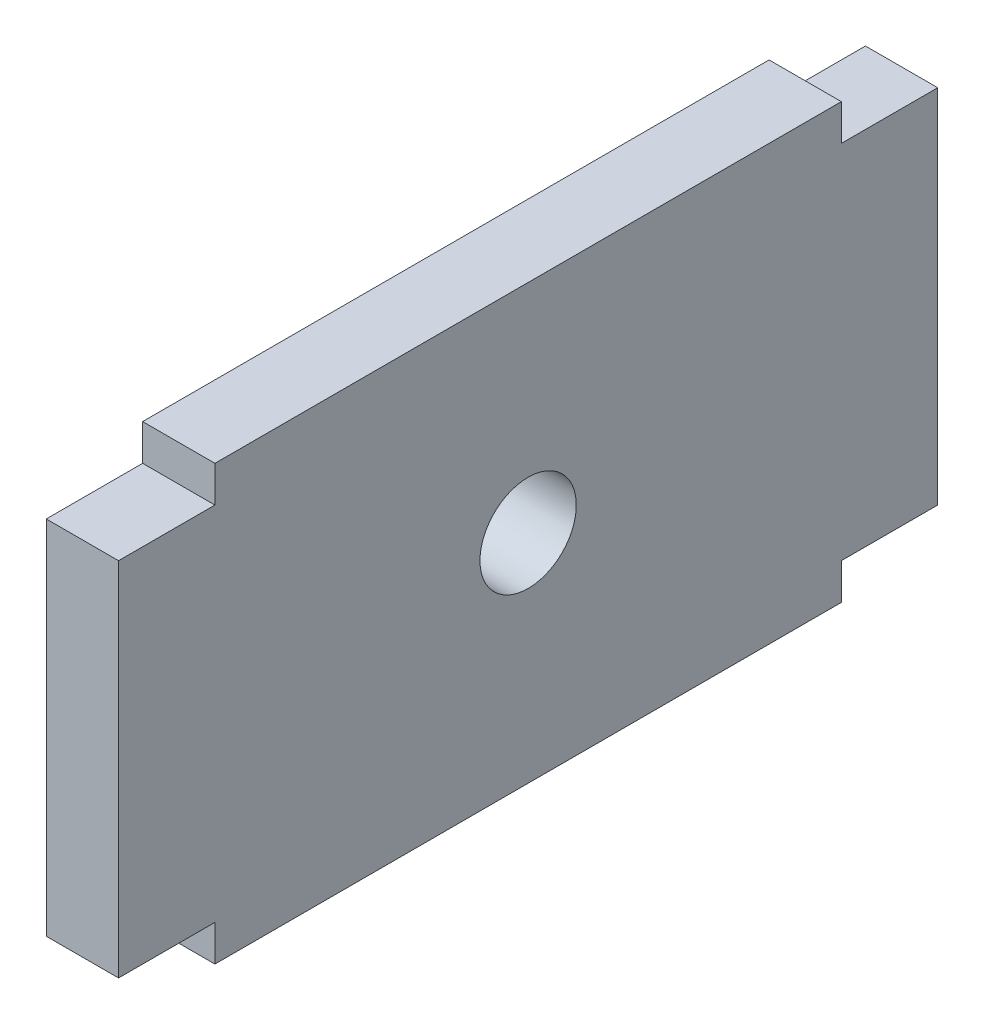
ISO-10303-21;
HEADER;
FILE_DESCRIPTION(('STEP AP214'),'2;1');
FILE_NAME('part.step','',(''),(''),'','','');
FILE_SCHEMA(('AUTOMOTIVE_DESIGN { 1 0 10303 214 1 1 1 1 }'));
ENDSEC;
DATA;
#1=APPLICATION_CONTEXT('core data for automotive mechanical design processes');
#2=APPLICATION_PROTOCOL_DEFINITION('international standard','automotive_design',2000,#1);
#3=PRODUCT_CONTEXT('',#1,'mechanical');
#4=PRODUCT('Part','Part','',(#3));
#5=PRODUCT_RELATED_PRODUCT_CATEGORY('part','',(#4));
#6=PRODUCT_DEFINITION_FORMATION('','',#4);
#7=PRODUCT_DEFINITION_CONTEXT('part definition',#1,'design');
#8=PRODUCT_DEFINITION('design','',#6,#7);
#9=PRODUCT_DEFINITION_SHAPE('','',#8);
#10=(LENGTH_UNIT() NAMED_UNIT(*) SI_UNIT(.MILLI.,.METRE.));
#11=(NAMED_UNIT(*) PLANE_ANGLE_UNIT() SI_UNIT($,.RADIAN.));
#12=(NAMED_UNIT(*) SI_UNIT($,.STERADIAN.) SOLID_ANGLE_UNIT());
#13=UNCERTAINTY_MEASURE_WITH_UNIT(LENGTH_MEASURE(1.E-05),#10,'distance_accuracy_value','');
#14=(GEOMETRIC_REPRESENTATION_CONTEXT(3) GLOBAL_UNCERTAINTY_ASSIGNED_CONTEXT((#13)) GLOBAL_UNIT_ASSIGNED_CONTEXT((#10,
#11,#12)) REPRESENTATION_CONTEXT('',''));
#15=CARTESIAN_POINT('',(0.,0.,0.));
#16=DIRECTION('',(0.,0.,1.));
#17=DIRECTION('',(1.,0.,0.));
#18=AXIS2_PLACEMENT_3D('',#15,#16,#17);
#19=CARTESIAN_POINT('',(3.,3.92310136729223,9.83223183914209));
#20=DIRECTION('',(0.,0.,-1.));
#21=DIRECTION('',(0.,1.,0.));
#22=AXIS2_PLACEMENT_3D('',#19,#20,#21);
#23=PLANE('',#22);
#24=DIRECTION('',(0.,-1.,0.));
#25=VECTOR('',#24,1.);
#26=CARTESIAN_POINT('',(0.,3.92310136729223,9.83223183914209));
#27=LINE('',#26,#25);
#28=CARTESIAN_POINT('',(0.,3.92310136729223,9.83223183914209));
#29=VERTEX_POINT('',#28);
#30=CARTESIAN_POINT('',(0.,2.42310136729223,9.83223183914209));
#31=VERTEX_POINT('',#30);
#32=EDGE_CURVE('E152',#29,#31,#27,.T.);
#33=ORIENTED_EDGE('',*,*,#32,.T.);
#34=DIRECTION('',(-1.,0.,0.));
#35=VECTOR('',#34,1.);
#36=CARTESIAN_POINT('',(3.,2.42310136729223,9.83223183914209));
#37=LINE('',#36,#35);
#38=CARTESIAN_POINT('',(3.,2.42310136729223,9.83223183914209));
#39=VERTEX_POINT('',#38);
#40=EDGE_CURVE('E11',#39,#31,#37,.T.);
#41=ORIENTED_EDGE('',*,*,#40,.F.);
#42=DIRECTION('',(0.,-1.,0.));
#43=VECTOR('',#42,1.);
#44=CARTESIAN_POINT('',(3.,3.92310136729223,9.83223183914209));
#45=LINE('',#44,#43);
#46=CARTESIAN_POINT('',(3.,3.92310136729223,9.83223183914209));
#47=VERTEX_POINT('',#46);
#48=EDGE_CURVE('E175',#47,#39,#45,.T.);
#49=ORIENTED_EDGE('',*,*,#48,.F.);
#50=DIRECTION('',(-1.,0.,0.));
#51=VECTOR('',#50,1.);
#52=CARTESIAN_POINT('',(3.,3.92310136729223,9.83223183914209));
#53=LINE('',#52,#51);
#54=EDGE_CURVE('E148',#47,#29,#53,.T.);
#55=ORIENTED_EDGE('',*,*,#54,.T.);
#56=EDGE_LOOP('',(#33,#41,#49,#55));
#57=FACE_BOUND('',#56,.T.);
#58=ADVANCED_FACE('F32',(#57),#23,.F.);
#59=CARTESIAN_POINT('',(3.,2.42310136729223,9.83223183914209));
#60=DIRECTION('',(0.,-1.,0.));
#61=DIRECTION('',(0.,0.,-1.));
#62=AXIS2_PLACEMENT_3D('',#59,#60,#61);
#63=PLANE('',#62);
#64=DIRECTION('',(0.,0.,1.));
#65=VECTOR('',#64,1.);
#66=CARTESIAN_POINT('',(0.,2.42310136729223,9.83223183914209));
#67=LINE('',#66,#65);
#68=CARTESIAN_POINT('',(0.,2.42310136729223,13.8322318391421));
#69=VERTEX_POINT('',#68);
#70=EDGE_CURVE('E155',#31,#69,#67,.T.);
#71=ORIENTED_EDGE('',*,*,#70,.T.);
#72=DIRECTION('',(-1.,0.,0.));
#73=VECTOR('',#72,1.);
#74=CARTESIAN_POINT('',(3.,2.42310136729223,13.8322318391421));
#75=LINE('',#74,#73);
#76=CARTESIAN_POINT('',(3.,2.42310136729223,13.8322318391421));
#77=VERTEX_POINT('',#76);
#78=EDGE_CURVE('E40',#77,#69,#75,.T.);
#79=ORIENTED_EDGE('',*,*,#78,.F.);
#80=DIRECTION('',(0.,0.,1.));
#81=VECTOR('',#80,1.);
#82=CARTESIAN_POINT('',(3.,2.42310136729223,9.83223183914209));
#83=LINE('',#82,#81);
#84=EDGE_CURVE('E103',#39,#77,#83,.T.);
#85=ORIENTED_EDGE('',*,*,#84,.F.);
#86=ORIENTED_EDGE('',*,*,#40,.T.);
#87=EDGE_LOOP('',(#71,#79,#85,#86));
#88=FACE_BOUND('',#87,.T.);
#89=ADVANCED_FACE('F254',(#88),#63,.F.);
#90=CARTESIAN_POINT('',(3.,2.42310136729223,13.8322318391421));
#91=DIRECTION('',(0.,0.,-1.));
#92=DIRECTION('',(0.,1.,0.));
#93=AXIS2_PLACEMENT_3D('',#90,#91,#92);
#94=PLANE('',#93);
#95=DIRECTION('',(0.,-1.,0.));
#96=VECTOR('',#95,1.);
#97=CARTESIAN_POINT('',(0.,2.42310136729223,13.8322318391421));
#98=LINE('',#97,#96);
#99=CARTESIAN_POINT('',(0.,-12.5768986327078,13.8322318391421));
#100=VERTEX_POINT('',#99);
#101=EDGE_CURVE('E158',#69,#100,#98,.T.);
#102=ORIENTED_EDGE('',*,*,#101,.T.);
#103=DIRECTION('',(-1.,0.,0.));
#104=VECTOR('',#103,1.);
#105=CARTESIAN_POINT('',(3.,-12.5768986327078,13.8322318391421));
#106=LINE('',#105,#104);
#107=CARTESIAN_POINT('',(3.,-12.5768986327078,13.8322318391421));
#108=VERTEX_POINT('',#107);
#109=EDGE_CURVE('E194',#108,#100,#106,.T.);
#110=ORIENTED_EDGE('',*,*,#109,.F.);
#111=DIRECTION('',(0.,-1.,0.));
#112=VECTOR('',#111,1.);
#113=CARTESIAN_POINT('',(3.,2.42310136729223,13.8322318391421));
#114=LINE('',#113,#112);
#115=EDGE_CURVE('E202',#77,#108,#114,.T.);
#116=ORIENTED_EDGE('',*,*,#115,.F.);
#117=ORIENTED_EDGE('',*,*,#78,.T.);
#118=EDGE_LOOP('',(#102,#110,#116,#117));
#119=FACE_BOUND('',#118,.T.);
#120=ADVANCED_FACE('F200',(#119),#94,.F.);
#121=CARTESIAN_POINT('',(3.,-12.5768986327078,13.8322318391421));
#122=DIRECTION('',(0.,1.,0.));
#123=DIRECTION('',(0.,0.,1.));
#124=AXIS2_PLACEMENT_3D('',#121,#122,#123);
#125=PLANE('',#124);
#126=DIRECTION('',(0.,0.,-1.));
#127=VECTOR('',#126,1.);
#128=CARTESIAN_POINT('',(0.,-12.5768986327078,13.8322318391421));
#129=LINE('',#128,#127);
#130=CARTESIAN_POINT('',(0.,-12.5768986327078,9.83223183914209));
#131=VERTEX_POINT('',#130);
#132=EDGE_CURVE('E160',#100,#131,#129,.T.);
#133=ORIENTED_EDGE('',*,*,#132,.T.);
#134=DIRECTION('',(-1.,0.,0.));
#135=VECTOR('',#134,1.);
#136=CARTESIAN_POINT('',(3.,-12.5768986327078,9.83223183914209));
#137=LINE('',#136,#135);
#138=CARTESIAN_POINT('',(3.,-12.5768986327078,9.83223183914209));
#139=VERTEX_POINT('',#138);
#140=EDGE_CURVE('E191',#139,#131,#137,.T.);
#141=ORIENTED_EDGE('',*,*,#140,.F.);
#142=DIRECTION('',(0.,0.,-1.));
#143=VECTOR('',#142,1.);
#144=CARTESIAN_POINT('',(3.,-12.5768986327078,13.8322318391421));
#145=LINE('',#144,#143);
#146=EDGE_CURVE('E220',#108,#139,#145,.T.);
#147=ORIENTED_EDGE('',*,*,#146,.F.);
#148=ORIENTED_EDGE('',*,*,#109,.T.);
#149=EDGE_LOOP('',(#133,#141,#147,#148));
#150=FACE_BOUND('',#149,.T.);
#151=ADVANCED_FACE('F211',(#150),#125,.F.);
#152=CARTESIAN_POINT('',(3.,-12.5768986327078,9.83223183914209));
#153=DIRECTION('',(0.,0.,-1.));
#154=DIRECTION('',(0.,1.,0.));
#155=AXIS2_PLACEMENT_3D('',#152,#153,#154);
#156=PLANE('',#155);
#157=DIRECTION('',(0.,-1.,0.));
#158=VECTOR('',#157,1.);
#159=CARTESIAN_POINT('',(0.,-12.5768986327078,9.83223183914209));
#160=LINE('',#159,#158);
#161=CARTESIAN_POINT('',(0.,-14.0768986327078,9.83223183914209));
#162=VERTEX_POINT('',#161);
#163=EDGE_CURVE('E162',#131,#162,#160,.T.);
#164=ORIENTED_EDGE('',*,*,#163,.T.);
#165=DIRECTION('',(-1.,0.,0.));
#166=VECTOR('',#165,1.);
#167=CARTESIAN_POINT('',(3.,-14.0768986327078,9.83223183914209));
#168=LINE('',#167,#166);
#169=CARTESIAN_POINT('',(3.,-14.0768986327078,9.83223183914209));
#170=VERTEX_POINT('',#169);
#171=EDGE_CURVE('E188',#170,#162,#168,.T.);
#172=ORIENTED_EDGE('',*,*,#171,.F.);
#173=DIRECTION('',(0.,-1.,0.));
#174=VECTOR('',#173,1.);
#175=CARTESIAN_POINT('',(3.,-12.5768986327078,9.83223183914209));
#176=LINE('',#175,#174);
#177=EDGE_CURVE('E217',#139,#170,#176,.T.);
#178=ORIENTED_EDGE('',*,*,#177,.F.);
#179=ORIENTED_EDGE('',*,*,#140,.T.);
#180=EDGE_LOOP('',(#164,#172,#178,#179));
#181=FACE_BOUND('',#180,.T.);
#182=ADVANCED_FACE('F215',(#181),#156,.F.);
#183=CARTESIAN_POINT('',(3.,-14.0768986327078,9.83223183914209));
#184=DIRECTION('',(0.,1.,0.));
#185=DIRECTION('',(0.,0.,1.));
#186=AXIS2_PLACEMENT_3D('',#183,#184,#185);
#187=PLANE('',#186);
#188=DIRECTION('',(0.,0.,-1.));
#189=VECTOR('',#188,1.);
#190=CARTESIAN_POINT('',(0.,-14.0768986327078,9.83223183914209));
#191=LINE('',#190,#189);
#192=CARTESIAN_POINT('',(0.,-14.0768986327078,-16.1677681608579));
#193=VERTEX_POINT('',#192);
#194=EDGE_CURVE('E164',#162,#193,#191,.T.);
#195=ORIENTED_EDGE('',*,*,#194,.T.);
#196=DIRECTION('',(-1.,0.,0.));
#197=VECTOR('',#196,1.);
#198=CARTESIAN_POINT('',(3.,-14.0768986327078,-16.1677681608579));
#199=LINE('',#198,#197);
#200=CARTESIAN_POINT('',(3.,-14.0768986327078,-16.1677681608579));
#201=VERTEX_POINT('',#200);
#202=EDGE_CURVE('E185',#201,#193,#199,.T.);
#203=ORIENTED_EDGE('',*,*,#202,.F.);
#204=DIRECTION('',(0.,0.,-1.));
#205=VECTOR('',#204,1.);
#206=CARTESIAN_POINT('',(3.,-14.0768986327078,9.83223183914209));
#207=LINE('',#206,#205);
#208=EDGE_CURVE('E219',#170,#201,#207,.T.);
#209=ORIENTED_EDGE('',*,*,#208,.F.);
#210=ORIENTED_EDGE('',*,*,#171,.T.);
#211=EDGE_LOOP('',(#195,#203,#209,#210));
#212=FACE_BOUND('',#211,.T.);
#213=ADVANCED_FACE('F267',(#212),#187,.F.);
#214=CARTESIAN_POINT('',(3.,-12.5768986327078,-16.1677681608579));
#215=DIRECTION('',(0.,0.,1.));
#216=DIRECTION('',(0.,-1.,0.));
#217=AXIS2_PLACEMENT_3D('',#214,#215,#216);
#218=PLANE('',#217);
#219=DIRECTION('',(0.,1.,0.));
#220=VECTOR('',#219,1.);
#221=CARTESIAN_POINT('',(0.,-12.5768986327078,-16.1677681608579));
#222=LINE('',#221,#220);
#223=CARTESIAN_POINT('',(0.,-12.5768986327078,-16.1677681608579));
#224=VERTEX_POINT('',#223);
#225=EDGE_CURVE('E166',#193,#224,#222,.T.);
#226=ORIENTED_EDGE('',*,*,#225,.T.);
#227=DIRECTION('',(-1.,0.,0.));
#228=VECTOR('',#227,1.);
#229=CARTESIAN_POINT('',(3.,-12.5768986327078,-16.1677681608579));
#230=LINE('',#229,#228);
#231=CARTESIAN_POINT('',(3.,-12.5768986327078,-16.1677681608579));
#232=VERTEX_POINT('',#231);
#233=EDGE_CURVE('E182',#232,#224,#230,.T.);
#234=ORIENTED_EDGE('',*,*,#233,.F.);
#235=DIRECTION('',(0.,1.,0.));
#236=VECTOR('',#235,1.);
#237=CARTESIAN_POINT('',(3.,-12.5768986327078,-16.1677681608579));
#238=LINE('',#237,#236);
#239=EDGE_CURVE('E222',#201,#232,#238,.T.);
#240=ORIENTED_EDGE('',*,*,#239,.F.);
#241=ORIENTED_EDGE('',*,*,#202,.T.);
#242=EDGE_LOOP('',(#226,#234,#240,#241));
#243=FACE_BOUND('',#242,.T.);
#244=ADVANCED_FACE('F270',(#243),#218,.F.);
#245=CARTESIAN_POINT('',(3.,-12.5768986327078,-20.1677681608579));
#246=DIRECTION('',(0.,1.,0.));
#247=DIRECTION('',(0.,0.,1.));
#248=AXIS2_PLACEMENT_3D('',#245,#246,#247);
#249=PLANE('',#248);
#250=DIRECTION('',(0.,0.,-1.));
#251=VECTOR('',#250,1.);
#252=CARTESIAN_POINT('',(0.,-12.5768986327078,-20.1677681608579));
#253=LINE('',#252,#251);
#254=CARTESIAN_POINT('',(0.,-12.5768986327078,-20.1677681608579));
#255=VERTEX_POINT('',#254);
#256=EDGE_CURVE('E168',#224,#255,#253,.T.);
#257=ORIENTED_EDGE('',*,*,#256,.T.);
#258=DIRECTION('',(-1.,0.,0.));
#259=VECTOR('',#258,1.);
#260=CARTESIAN_POINT('',(3.,-12.5768986327078,-20.1677681608579));
#261=LINE('',#260,#259);
#262=CARTESIAN_POINT('',(3.,-12.5768986327078,-20.1677681608579));
#263=VERTEX_POINT('',#262);
#264=EDGE_CURVE('E179',#263,#255,#261,.T.);
#265=ORIENTED_EDGE('',*,*,#264,.F.);
#266=DIRECTION('',(0.,0.,-1.));
#267=VECTOR('',#266,1.);
#268=CARTESIAN_POINT('',(3.,-12.5768986327078,-20.1677681608579));
#269=LINE('',#268,#267);
#270=EDGE_CURVE('E228',#232,#263,#269,.T.);
#271=ORIENTED_EDGE('',*,*,#270,.F.);
#272=ORIENTED_EDGE('',*,*,#233,.T.);
#273=EDGE_LOOP('',(#257,#265,#271,#272));
#274=FACE_BOUND('',#273,.T.);
#275=ADVANCED_FACE('F234',(#274),#249,.F.);
#276=CARTESIAN_POINT('',(3.,2.42310136729223,-20.1677681608579));
#277=DIRECTION('',(0.,0.,1.));
#278=DIRECTION('',(0.,-1.,0.));
#279=AXIS2_PLACEMENT_3D('',#276,#277,#278);
#280=PLANE('',#279);
#281=DIRECTION('',(0.,1.,0.));
#282=VECTOR('',#281,1.);
#283=CARTESIAN_POINT('',(0.,2.42310136729223,-20.1677681608579));
#284=LINE('',#283,#282);
#285=CARTESIAN_POINT('',(0.,2.42310136729223,-20.1677681608579));
#286=VERTEX_POINT('',#285);
#287=EDGE_CURVE('E170',#255,#286,#284,.T.);
#288=ORIENTED_EDGE('',*,*,#287,.T.);
#289=DIRECTION('',(-1.,0.,0.));
#290=VECTOR('',#289,1.);
#291=CARTESIAN_POINT('',(3.,2.42310136729223,-20.1677681608579));
#292=LINE('',#291,#290);
#293=CARTESIAN_POINT('',(3.,2.42310136729223,-20.1677681608579));
#294=VERTEX_POINT('',#293);
#295=EDGE_CURVE('E143',#294,#286,#292,.T.);
#296=ORIENTED_EDGE('',*,*,#295,.F.);
#297=DIRECTION('',(0.,1.,0.));
#298=VECTOR('',#297,1.);
#299=CARTESIAN_POINT('',(3.,2.42310136729223,-20.1677681608579));
#300=LINE('',#299,#298);
#301=EDGE_CURVE('E134',#263,#294,#300,.T.);
#302=ORIENTED_EDGE('',*,*,#301,.F.);
#303=ORIENTED_EDGE('',*,*,#264,.T.);
#304=EDGE_LOOP('',(#288,#296,#302,#303));
#305=FACE_BOUND('',#304,.T.);
#306=ADVANCED_FACE('F238',(#305),#280,.F.);
#307=CARTESIAN_POINT('',(3.,2.42310136729223,-16.1677681608579));
#308=DIRECTION('',(0.,-1.,0.));
#309=DIRECTION('',(0.,0.,-1.));
#310=AXIS2_PLACEMENT_3D('',#307,#308,#309);
#311=PLANE('',#310);
#312=DIRECTION('',(0.,0.,1.));
#313=VECTOR('',#312,1.);
#314=CARTESIAN_POINT('',(0.,2.42310136729223,-16.1677681608579));
#315=LINE('',#314,#313);
#316=CARTESIAN_POINT('',(0.,2.42310136729223,-16.1677681608579));
#317=VERTEX_POINT('',#316);
#318=EDGE_CURVE('E142',#286,#317,#315,.T.);
#319=ORIENTED_EDGE('',*,*,#318,.T.);
#320=DIRECTION('',(-1.,0.,0.));
#321=VECTOR('',#320,1.);
#322=CARTESIAN_POINT('',(3.,2.42310136729223,-16.1677681608579));
#323=LINE('',#322,#321);
#324=CARTESIAN_POINT('',(3.,2.42310136729223,-16.1677681608579));
#325=VERTEX_POINT('',#324);
#326=EDGE_CURVE('E139',#325,#317,#323,.T.);
#327=ORIENTED_EDGE('',*,*,#326,.F.);
#328=DIRECTION('',(0.,0.,1.));
#329=VECTOR('',#328,1.);
#330=CARTESIAN_POINT('',(3.,2.42310136729223,-16.1677681608579));
#331=LINE('',#330,#329);
#332=EDGE_CURVE('E128',#294,#325,#331,.T.);
#333=ORIENTED_EDGE('',*,*,#332,.F.);
#334=ORIENTED_EDGE('',*,*,#295,.T.);
#335=EDGE_LOOP('',(#319,#327,#333,#334));
#336=FACE_BOUND('',#335,.T.);
#337=ADVANCED_FACE('F140',(#336),#311,.F.);
#338=CARTESIAN_POINT('',(3.,3.92310136729223,-16.1677681608579));
#339=DIRECTION('',(0.,0.,1.));
#340=DIRECTION('',(1.,0.,0.));
#341=AXIS2_PLACEMENT_3D('',#338,#339,#340);
#342=PLANE('',#341);
#343=DIRECTION('',(0.,1.,0.));
#344=VECTOR('',#343,1.);
#345=CARTESIAN_POINT('',(0.,3.92310136729223,-16.1677681608579));
#346=LINE('',#345,#344);
#347=CARTESIAN_POINT('',(0.,3.92310136729223,-16.1677681608579));
#348=VERTEX_POINT('',#347);
#349=EDGE_CURVE('E89',#317,#348,#346,.T.);
#350=ORIENTED_EDGE('',*,*,#349,.T.);
#351=DIRECTION('',(-1.,0.,0.));
#352=VECTOR('',#351,1.);
#353=CARTESIAN_POINT('',(3.,3.92310136729223,-16.1677681608579));
#354=LINE('',#353,#352);
#355=CARTESIAN_POINT('',(3.,3.92310136729223,-16.1677681608579));
#356=VERTEX_POINT('',#355);
#357=EDGE_CURVE('E144',#356,#348,#354,.T.);
#358=ORIENTED_EDGE('',*,*,#357,.F.);
#359=DIRECTION('',(0.,1.,0.));
#360=VECTOR('',#359,1.);
#361=CARTESIAN_POINT('',(3.,3.92310136729223,-16.1677681608579));
#362=LINE('',#361,#360);
#363=EDGE_CURVE('E132',#325,#356,#362,.T.);
#364=ORIENTED_EDGE('',*,*,#363,.F.);
#365=ORIENTED_EDGE('',*,*,#326,.T.);
#366=EDGE_LOOP('',(#350,#358,#364,#365));
#367=FACE_BOUND('',#366,.T.);
#368=ADVANCED_FACE('F146',(#367),#342,.F.);
#369=CARTESIAN_POINT('',(3.,3.92310136729223,9.83223183914209));
#370=DIRECTION('',(0.,-1.,0.));
#371=DIRECTION('',(0.,0.,-1.));
#372=AXIS2_PLACEMENT_3D('',#369,#370,#371);
#373=PLANE('',#372);
#374=DIRECTION('',(0.,0.,1.));
#375=VECTOR('',#374,1.);
#376=CARTESIAN_POINT('',(0.,3.92310136729223,9.83223183914209));
#377=LINE('',#376,#375);
#378=EDGE_CURVE('E95',#348,#29,#377,.T.);
#379=ORIENTED_EDGE('',*,*,#378,.T.);
#380=ORIENTED_EDGE('',*,*,#54,.F.);
#381=DIRECTION('',(0.,0.,1.));
#382=VECTOR('',#381,1.);
#383=CARTESIAN_POINT('',(3.,3.92310136729223,9.83223183914209));
#384=LINE('',#383,#382);
#385=EDGE_CURVE('E48',#356,#47,#384,.T.);
#386=ORIENTED_EDGE('',*,*,#385,.F.);
#387=ORIENTED_EDGE('',*,*,#357,.T.);
#388=EDGE_LOOP('',(#379,#380,#386,#387));
#389=FACE_BOUND('',#388,.T.);
#390=ADVANCED_FACE('F242',(#389),#373,.F.);
#391=CARTESIAN_POINT('',(3.,0.,0.));
#392=DIRECTION('',(-1.,0.,0.));
#393=DIRECTION('',(0.,0.,1.));
#394=AXIS2_PLACEMENT_3D('',#391,#392,#393);
#395=PLANE('',#394);
#396=CARTESIAN_POINT('',(3.,-5.07689863270777,-3.16776816085791));
#397=DIRECTION('',(-1.,0.,0.));
#398=DIRECTION('',(0.,0.,1.));
#399=AXIS2_PLACEMENT_3D('',#396,#397,#398);
#400=CIRCLE('',#399,2.);
#401=CARTESIAN_POINT('',(3.,-5.07689863270777,-1.16776816085791));
#402=VERTEX_POINT('',#401);
#403=EDGE_CURVE('E156',#402,#402,#400,.T.);
#404=ORIENTED_EDGE('',*,*,#403,.T.);
#405=EDGE_LOOP('',(#404));
#406=FACE_BOUND('',#405,.T.);
#407=ORIENTED_EDGE('',*,*,#48,.T.);
#408=ORIENTED_EDGE('',*,*,#84,.T.);
#409=ORIENTED_EDGE('',*,*,#115,.T.);
#410=ORIENTED_EDGE('',*,*,#146,.T.);
#411=ORIENTED_EDGE('',*,*,#177,.T.);
#412=ORIENTED_EDGE('',*,*,#208,.T.);
#413=ORIENTED_EDGE('',*,*,#239,.T.);
#414=ORIENTED_EDGE('',*,*,#270,.T.);
#415=ORIENTED_EDGE('',*,*,#301,.T.);
#416=ORIENTED_EDGE('',*,*,#332,.T.);
#417=ORIENTED_EDGE('',*,*,#363,.T.);
#418=ORIENTED_EDGE('',*,*,#385,.T.);
#419=EDGE_LOOP('',(#407,#408,#409,#410,#411,#412,#413,#414,#415,#416,#417,#418));
#420=FACE_BOUND('',#419,.T.);
#421=ADVANCED_FACE('F130',(#406,#420),#395,.F.);
#422=CARTESIAN_POINT('',(0.,0.,0.));
#423=DIRECTION('',(-1.,0.,0.));
#424=DIRECTION('',(0.,0.,1.));
#425=AXIS2_PLACEMENT_3D('',#422,#423,#424);
#426=PLANE('',#425);
#427=CARTESIAN_POINT('',(0.,-5.07689863270777,-3.16776816085791));
#428=DIRECTION('',(-1.,0.,0.));
#429=DIRECTION('',(0.,0.,1.));
#430=AXIS2_PLACEMENT_3D('',#427,#428,#429);
#431=CIRCLE('',#430,2.);
#432=CARTESIAN_POINT('',(0.,-5.07689863270777,-1.16776816085791));
#433=VERTEX_POINT('',#432);
#434=EDGE_CURVE('E325',#433,#433,#431,.T.);
#435=ORIENTED_EDGE('',*,*,#434,.F.);
#436=EDGE_LOOP('',(#435));
#437=FACE_BOUND('',#436,.T.);
#438=ORIENTED_EDGE('',*,*,#32,.F.);
#439=ORIENTED_EDGE('',*,*,#378,.F.);
#440=ORIENTED_EDGE('',*,*,#349,.F.);
#441=ORIENTED_EDGE('',*,*,#318,.F.);
#442=ORIENTED_EDGE('',*,*,#287,.F.);
#443=ORIENTED_EDGE('',*,*,#256,.F.);
#444=ORIENTED_EDGE('',*,*,#225,.F.);
#445=ORIENTED_EDGE('',*,*,#194,.F.);
#446=ORIENTED_EDGE('',*,*,#163,.F.);
#447=ORIENTED_EDGE('',*,*,#132,.F.);
#448=ORIENTED_EDGE('',*,*,#101,.F.);
#449=ORIENTED_EDGE('',*,*,#70,.F.);
#450=EDGE_LOOP('',(#438,#439,#440,#441,#442,#443,#444,#445,#446,#447,#448,#449));
#451=FACE_BOUND('',#450,.T.);
#452=ADVANCED_FACE('F206',(#437,#451),#426,.T.);
#453=CARTESIAN_POINT('',(3.,-5.07689863270777,-3.16776816085791));
#454=DIRECTION('',(-1.,0.,0.));
#455=DIRECTION('',(0.,0.,1.));
#456=AXIS2_PLACEMENT_3D('',#453,#454,#455);
#457=CYLINDRICAL_SURFACE('',#456,2.);
#458=ORIENTED_EDGE('',*,*,#403,.F.);
#459=EDGE_LOOP('',(#458));
#460=FACE_BOUND('',#459,.T.);
#461=ORIENTED_EDGE('',*,*,#434,.T.);
#462=EDGE_LOOP('',(#461));
#463=FACE_BOUND('',#462,.T.);
#464=ADVANCED_FACE('F307',(#460,#463),#457,.F.);
#465=CLOSED_SHELL('',(#58,#89,#120,#151,#182,#213,#244,#275,#306,#337,#368,#390,#421,#452,#464));
#466=MANIFOLD_SOLID_BREP('B2',#465);
#467=ADVANCED_BREP_SHAPE_REPRESENTATION('',(#18,#466),#14);
#468=SHAPE_DEFINITION_REPRESENTATION(#9,#467);
ENDSEC;
END-ISO-10303-21;
